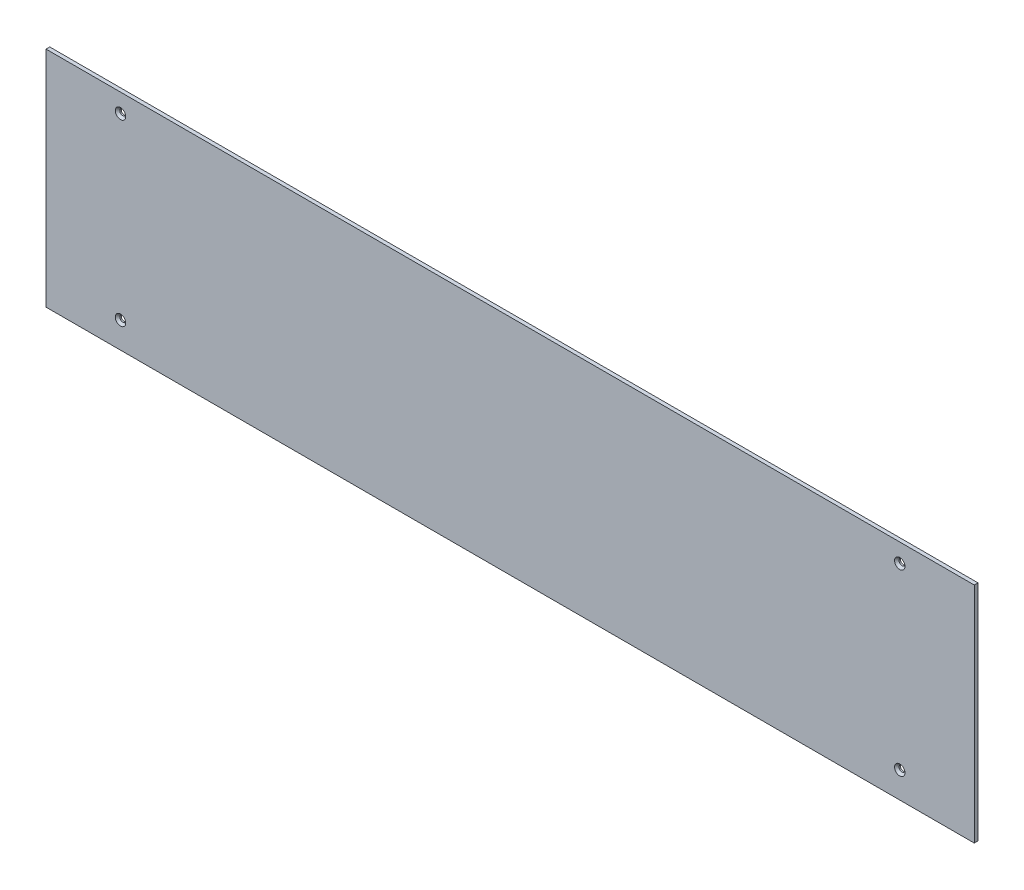
ISO-10303-21;
HEADER;
FILE_DESCRIPTION(('STEP AP214'),'2;1');
FILE_NAME('part.step','',(''),(''),'','','');
FILE_SCHEMA(('AUTOMOTIVE_DESIGN { 1 0 10303 214 1 1 1 1 }'));
ENDSEC;
DATA;
#1=APPLICATION_CONTEXT('core data for automotive mechanical design processes');
#2=APPLICATION_PROTOCOL_DEFINITION('international standard','automotive_design',2000,#1);
#3=PRODUCT_CONTEXT('',#1,'mechanical');
#4=PRODUCT('Part','Part','',(#3));
#5=PRODUCT_RELATED_PRODUCT_CATEGORY('part','',(#4));
#6=PRODUCT_DEFINITION_FORMATION('','',#4);
#7=PRODUCT_DEFINITION_CONTEXT('part definition',#1,'design');
#8=PRODUCT_DEFINITION('design','',#6,#7);
#9=PRODUCT_DEFINITION_SHAPE('','',#8);
#10=(LENGTH_UNIT() NAMED_UNIT(*) SI_UNIT(.MILLI.,.METRE.));
#11=(NAMED_UNIT(*) PLANE_ANGLE_UNIT() SI_UNIT($,.RADIAN.));
#12=(NAMED_UNIT(*) SI_UNIT($,.STERADIAN.) SOLID_ANGLE_UNIT());
#13=UNCERTAINTY_MEASURE_WITH_UNIT(LENGTH_MEASURE(1.E-05),#10,'distance_accuracy_value','');
#14=(GEOMETRIC_REPRESENTATION_CONTEXT(3) GLOBAL_UNCERTAINTY_ASSIGNED_CONTEXT((#13)) GLOBAL_UNIT_ASSIGNED_CONTEXT((#10,
#11,#12)) REPRESENTATION_CONTEXT('',''));
#15=CARTESIAN_POINT('',(0.,0.,0.));
#16=DIRECTION('',(0.,0.,1.));
#17=DIRECTION('',(1.,0.,0.));
#18=AXIS2_PLACEMENT_3D('',#15,#16,#17);
#19=CARTESIAN_POINT('',(623.,-150.,5.));
#20=DIRECTION('',(-1.,0.,0.));
#21=DIRECTION('',(0.,0.,1.));
#22=AXIS2_PLACEMENT_3D('',#19,#20,#21);
#23=PLANE('',#22);
#24=DIRECTION('',(0.,1.,0.));
#25=VECTOR('',#24,1.);
#26=CARTESIAN_POINT('',(623.,-150.,0.));
#27=LINE('',#26,#25);
#28=CARTESIAN_POINT('',(623.,-150.,0.));
#29=VERTEX_POINT('',#28);
#30=CARTESIAN_POINT('',(623.,150.,0.));
#31=VERTEX_POINT('',#30);
#32=EDGE_CURVE('E103',#29,#31,#27,.T.);
#33=ORIENTED_EDGE('',*,*,#32,.T.);
#34=DIRECTION('',(0.,0.,-1.));
#35=VECTOR('',#34,1.);
#36=CARTESIAN_POINT('',(623.,150.,5.));
#37=LINE('',#36,#35);
#38=CARTESIAN_POINT('',(623.,150.,5.));
#39=VERTEX_POINT('',#38);
#40=EDGE_CURVE('E94',#39,#31,#37,.T.);
#41=ORIENTED_EDGE('',*,*,#40,.F.);
#42=DIRECTION('',(0.,1.,0.));
#43=VECTOR('',#42,1.);
#44=CARTESIAN_POINT('',(623.,-150.,5.));
#45=LINE('',#44,#43);
#46=CARTESIAN_POINT('',(623.,-150.,5.));
#47=VERTEX_POINT('',#46);
#48=EDGE_CURVE('E88',#47,#39,#45,.T.);
#49=ORIENTED_EDGE('',*,*,#48,.F.);
#50=DIRECTION('',(0.,0.,-1.));
#51=VECTOR('',#50,1.);
#52=CARTESIAN_POINT('',(623.,-150.,5.));
#53=LINE('',#52,#51);
#54=EDGE_CURVE('E99',#47,#29,#53,.T.);
#55=ORIENTED_EDGE('',*,*,#54,.T.);
#56=EDGE_LOOP('',(#33,#41,#49,#55));
#57=FACE_BOUND('',#56,.T.);
#58=ADVANCED_FACE('F35',(#57),#23,.F.);
#59=CARTESIAN_POINT('',(-623.,150.,5.));
#60=DIRECTION('',(0.,-1.,0.));
#61=DIRECTION('',(0.,0.,-1.));
#62=AXIS2_PLACEMENT_3D('',#59,#60,#61);
#63=PLANE('',#62);
#64=DIRECTION('',(-1.,0.,0.));
#65=VECTOR('',#64,1.);
#66=CARTESIAN_POINT('',(-623.,150.,0.));
#67=LINE('',#66,#65);
#68=CARTESIAN_POINT('',(-623.,150.,0.));
#69=VERTEX_POINT('',#68);
#70=EDGE_CURVE('E93',#31,#69,#67,.T.);
#71=ORIENTED_EDGE('',*,*,#70,.T.);
#72=DIRECTION('',(0.,0.,-1.));
#73=VECTOR('',#72,1.);
#74=CARTESIAN_POINT('',(-623.,150.,5.));
#75=LINE('',#74,#73);
#76=CARTESIAN_POINT('',(-623.,150.,5.));
#77=VERTEX_POINT('',#76);
#78=EDGE_CURVE('E91',#77,#69,#75,.T.);
#79=ORIENTED_EDGE('',*,*,#78,.F.);
#80=DIRECTION('',(-1.,0.,0.));
#81=VECTOR('',#80,1.);
#82=CARTESIAN_POINT('',(-623.,150.,5.));
#83=LINE('',#82,#81);
#84=EDGE_CURVE('E83',#39,#77,#83,.T.);
#85=ORIENTED_EDGE('',*,*,#84,.F.);
#86=ORIENTED_EDGE('',*,*,#40,.T.);
#87=EDGE_LOOP('',(#71,#79,#85,#86));
#88=FACE_BOUND('',#87,.T.);
#89=ADVANCED_FACE('F92',(#88),#63,.F.);
#90=CARTESIAN_POINT('',(-623.,-150.,5.));
#91=DIRECTION('',(1.,0.,0.));
#92=DIRECTION('',(0.,0.,-1.));
#93=AXIS2_PLACEMENT_3D('',#90,#91,#92);
#94=PLANE('',#93);
#95=DIRECTION('',(0.,-1.,0.));
#96=VECTOR('',#95,1.);
#97=CARTESIAN_POINT('',(-623.,-150.,0.));
#98=LINE('',#97,#96);
#99=CARTESIAN_POINT('',(-623.,-150.,0.));
#100=VERTEX_POINT('',#99);
#101=EDGE_CURVE('E69',#69,#100,#98,.T.);
#102=ORIENTED_EDGE('',*,*,#101,.T.);
#103=DIRECTION('',(0.,0.,-1.));
#104=VECTOR('',#103,1.);
#105=CARTESIAN_POINT('',(-623.,-150.,5.));
#106=LINE('',#105,#104);
#107=CARTESIAN_POINT('',(-623.,-150.,5.));
#108=VERTEX_POINT('',#107);
#109=EDGE_CURVE('E95',#108,#100,#106,.T.);
#110=ORIENTED_EDGE('',*,*,#109,.F.);
#111=DIRECTION('',(0.,-1.,0.));
#112=VECTOR('',#111,1.);
#113=CARTESIAN_POINT('',(-623.,-150.,5.));
#114=LINE('',#113,#112);
#115=EDGE_CURVE('E86',#77,#108,#114,.T.);
#116=ORIENTED_EDGE('',*,*,#115,.F.);
#117=ORIENTED_EDGE('',*,*,#78,.T.);
#118=EDGE_LOOP('',(#102,#110,#116,#117));
#119=FACE_BOUND('',#118,.T.);
#120=ADVANCED_FACE('F97',(#119),#94,.F.);
#121=CARTESIAN_POINT('',(-623.,-150.,5.));
#122=DIRECTION('',(0.,1.,0.));
#123=DIRECTION('',(0.,0.,1.));
#124=AXIS2_PLACEMENT_3D('',#121,#122,#123);
#125=PLANE('',#124);
#126=DIRECTION('',(1.,0.,0.));
#127=VECTOR('',#126,1.);
#128=CARTESIAN_POINT('',(-623.,-150.,0.));
#129=LINE('',#128,#127);
#130=EDGE_CURVE('E75',#100,#29,#129,.T.);
#131=ORIENTED_EDGE('',*,*,#130,.T.);
#132=ORIENTED_EDGE('',*,*,#54,.F.);
#133=DIRECTION('',(1.,0.,0.));
#134=VECTOR('',#133,1.);
#135=CARTESIAN_POINT('',(-623.,-150.,5.));
#136=LINE('',#135,#134);
#137=EDGE_CURVE('E52',#108,#47,#136,.T.);
#138=ORIENTED_EDGE('',*,*,#137,.F.);
#139=ORIENTED_EDGE('',*,*,#109,.T.);
#140=EDGE_LOOP('',(#131,#132,#138,#139));
#141=FACE_BOUND('',#140,.T.);
#142=ADVANCED_FACE('F202',(#141),#125,.F.);
#143=CARTESIAN_POINT('',(0.,0.,5.));
#144=DIRECTION('',(0.,0.,-1.));
#145=DIRECTION('',(-1.,0.,0.));
#146=AXIS2_PLACEMENT_3D('',#143,#144,#145);
#147=PLANE('',#146);
#148=CARTESIAN_POINT('',(-523.,-115.,5.));
#149=DIRECTION('',(0.,0.,-1.));
#150=DIRECTION('',(-1.,0.,0.));
#151=AXIS2_PLACEMENT_3D('',#148,#149,#150);
#152=CIRCLE('',#151,6.99999999999978);
#153=CARTESIAN_POINT('',(-530.,-115.,5.));
#154=VERTEX_POINT('',#153);
#155=EDGE_CURVE('E125',#154,#154,#152,.T.);
#156=ORIENTED_EDGE('',*,*,#155,.T.);
#157=EDGE_LOOP('',(#156));
#158=FACE_BOUND('',#157,.T.);
#159=CARTESIAN_POINT('',(523.,-115.,5.));
#160=DIRECTION('',(0.,0.,-1.));
#161=DIRECTION('',(-1.,0.,0.));
#162=AXIS2_PLACEMENT_3D('',#159,#160,#161);
#163=CIRCLE('',#162,6.99999999999978);
#164=CARTESIAN_POINT('',(516.,-115.,5.));
#165=VERTEX_POINT('',#164);
#166=EDGE_CURVE('E122',#165,#165,#163,.T.);
#167=ORIENTED_EDGE('',*,*,#166,.T.);
#168=EDGE_LOOP('',(#167));
#169=FACE_BOUND('',#168,.T.);
#170=CARTESIAN_POINT('',(523.,125.,5.));
#171=DIRECTION('',(0.,0.,-1.));
#172=DIRECTION('',(-1.,0.,0.));
#173=AXIS2_PLACEMENT_3D('',#170,#171,#172);
#174=CIRCLE('',#173,6.99999999999978);
#175=CARTESIAN_POINT('',(516.,125.,5.));
#176=VERTEX_POINT('',#175);
#177=EDGE_CURVE('E119',#176,#176,#174,.T.);
#178=ORIENTED_EDGE('',*,*,#177,.T.);
#179=EDGE_LOOP('',(#178));
#180=FACE_BOUND('',#179,.T.);
#181=CARTESIAN_POINT('',(-523.,125.,5.));
#182=DIRECTION('',(0.,0.,-1.));
#183=DIRECTION('',(-1.,0.,0.));
#184=AXIS2_PLACEMENT_3D('',#181,#182,#183);
#185=CIRCLE('',#184,6.99999999999978);
#186=CARTESIAN_POINT('',(-530.,125.,5.));
#187=VERTEX_POINT('',#186);
#188=EDGE_CURVE('E116',#187,#187,#185,.T.);
#189=ORIENTED_EDGE('',*,*,#188,.T.);
#190=EDGE_LOOP('',(#189));
#191=FACE_BOUND('',#190,.T.);
#192=ORIENTED_EDGE('',*,*,#48,.T.);
#193=ORIENTED_EDGE('',*,*,#84,.T.);
#194=ORIENTED_EDGE('',*,*,#115,.T.);
#195=ORIENTED_EDGE('',*,*,#137,.T.);
#196=EDGE_LOOP('',(#192,#193,#194,#195));
#197=FACE_BOUND('',#196,.T.);
#198=ADVANCED_FACE('F84',(#158,#169,#180,#191,#197),#147,.F.);
#199=CARTESIAN_POINT('',(0.,0.,0.));
#200=DIRECTION('',(0.,0.,-1.));
#201=DIRECTION('',(-1.,0.,0.));
#202=AXIS2_PLACEMENT_3D('',#199,#200,#201);
#203=PLANE('',#202);
#204=CARTESIAN_POINT('',(-523.,-115.,0.));
#205=DIRECTION('',(0.,0.,1.));
#206=DIRECTION('',(1.,0.,0.));
#207=AXIS2_PLACEMENT_3D('',#204,#205,#206);
#208=CIRCLE('',#207,3.99999999999999);
#209=CARTESIAN_POINT('',(-519.,-115.,0.));
#210=VERTEX_POINT('',#209);
#211=EDGE_CURVE('E173',#210,#210,#208,.T.);
#212=ORIENTED_EDGE('',*,*,#211,.T.);
#213=EDGE_LOOP('',(#212));
#214=FACE_BOUND('',#213,.T.);
#215=CARTESIAN_POINT('',(523.,-115.,0.));
#216=DIRECTION('',(0.,0.,1.));
#217=DIRECTION('',(1.,0.,0.));
#218=AXIS2_PLACEMENT_3D('',#215,#216,#217);
#219=CIRCLE('',#218,3.99999999999999);
#220=CARTESIAN_POINT('',(527.,-115.,0.));
#221=VERTEX_POINT('',#220);
#222=EDGE_CURVE('E175',#221,#221,#219,.T.);
#223=ORIENTED_EDGE('',*,*,#222,.T.);
#224=EDGE_LOOP('',(#223));
#225=FACE_BOUND('',#224,.T.);
#226=CARTESIAN_POINT('',(523.,125.,0.));
#227=DIRECTION('',(0.,0.,1.));
#228=DIRECTION('',(1.,0.,0.));
#229=AXIS2_PLACEMENT_3D('',#226,#227,#228);
#230=CIRCLE('',#229,3.99999999999999);
#231=CARTESIAN_POINT('',(527.,125.,0.));
#232=VERTEX_POINT('',#231);
#233=EDGE_CURVE('E178',#232,#232,#230,.T.);
#234=ORIENTED_EDGE('',*,*,#233,.T.);
#235=EDGE_LOOP('',(#234));
#236=FACE_BOUND('',#235,.T.);
#237=CARTESIAN_POINT('',(-523.,125.,0.));
#238=DIRECTION('',(0.,0.,1.));
#239=DIRECTION('',(1.,0.,0.));
#240=AXIS2_PLACEMENT_3D('',#237,#238,#239);
#241=CIRCLE('',#240,3.99999999999999);
#242=CARTESIAN_POINT('',(-519.,125.,0.));
#243=VERTEX_POINT('',#242);
#244=EDGE_CURVE('E106',#243,#243,#241,.T.);
#245=ORIENTED_EDGE('',*,*,#244,.T.);
#246=EDGE_LOOP('',(#245));
#247=FACE_BOUND('',#246,.T.);
#248=ORIENTED_EDGE('',*,*,#32,.F.);
#249=ORIENTED_EDGE('',*,*,#130,.F.);
#250=ORIENTED_EDGE('',*,*,#101,.F.);
#251=ORIENTED_EDGE('',*,*,#70,.F.);
#252=EDGE_LOOP('',(#248,#249,#250,#251));
#253=FACE_BOUND('',#252,.T.);
#254=ADVANCED_FACE('F186',(#214,#225,#236,#247,#253),#203,.T.);
#255=CARTESIAN_POINT('',(-523.,125.,0.));
#256=DIRECTION('',(0.,0.,1.));
#257=DIRECTION('',(1.,0.,0.));
#258=AXIS2_PLACEMENT_3D('',#255,#256,#257);
#259=CYLINDRICAL_SURFACE('',#258,3.99999999999999);
#260=CARTESIAN_POINT('',(-523.,125.,2.0000000000002));
#261=DIRECTION('',(0.,0.,-1.));
#262=DIRECTION('',(-1.,0.,0.));
#263=AXIS2_PLACEMENT_3D('',#260,#261,#262);
#264=CIRCLE('',#263,3.99999999999999);
#265=CARTESIAN_POINT('',(-527.,125.,2.0000000000002));
#266=VERTEX_POINT('',#265);
#267=EDGE_CURVE('E11',#266,#266,#264,.F.);
#268=ORIENTED_EDGE('',*,*,#267,.T.);
#269=EDGE_LOOP('',(#268));
#270=FACE_BOUND('',#269,.T.);
#271=ORIENTED_EDGE('',*,*,#244,.F.);
#272=EDGE_LOOP('',(#271));
#273=FACE_BOUND('',#272,.T.);
#274=ADVANCED_FACE('F189',(#270,#273),#259,.F.);
#275=CARTESIAN_POINT('',(523.,125.,0.));
#276=DIRECTION('',(0.,0.,1.));
#277=DIRECTION('',(1.,0.,0.));
#278=AXIS2_PLACEMENT_3D('',#275,#276,#277);
#279=CYLINDRICAL_SURFACE('',#278,3.99999999999999);
#280=CARTESIAN_POINT('',(523.,125.,2.0000000000002));
#281=DIRECTION('',(0.,0.,-1.));
#282=DIRECTION('',(-1.,0.,0.));
#283=AXIS2_PLACEMENT_3D('',#280,#281,#282);
#284=CIRCLE('',#283,3.99999999999999);
#285=CARTESIAN_POINT('',(519.,125.,2.0000000000002));
#286=VERTEX_POINT('',#285);
#287=EDGE_CURVE('E44',#286,#286,#284,.F.);
#288=ORIENTED_EDGE('',*,*,#287,.T.);
#289=EDGE_LOOP('',(#288));
#290=FACE_BOUND('',#289,.T.);
#291=ORIENTED_EDGE('',*,*,#233,.F.);
#292=EDGE_LOOP('',(#291));
#293=FACE_BOUND('',#292,.T.);
#294=ADVANCED_FACE('F133',(#290,#293),#279,.F.);
#295=CARTESIAN_POINT('',(523.,-115.,0.));
#296=DIRECTION('',(0.,0.,1.));
#297=DIRECTION('',(1.,0.,0.));
#298=AXIS2_PLACEMENT_3D('',#295,#296,#297);
#299=CYLINDRICAL_SURFACE('',#298,3.99999999999999);
#300=CARTESIAN_POINT('',(523.,-115.,2.0000000000002));
#301=DIRECTION('',(0.,0.,-1.));
#302=DIRECTION('',(-1.,0.,0.));
#303=AXIS2_PLACEMENT_3D('',#300,#301,#302);
#304=CIRCLE('',#303,3.99999999999999);
#305=CARTESIAN_POINT('',(519.,-115.,2.0000000000002));
#306=VERTEX_POINT('',#305);
#307=EDGE_CURVE('E128',#306,#306,#304,.F.);
#308=ORIENTED_EDGE('',*,*,#307,.T.);
#309=EDGE_LOOP('',(#308));
#310=FACE_BOUND('',#309,.T.);
#311=ORIENTED_EDGE('',*,*,#222,.F.);
#312=EDGE_LOOP('',(#311));
#313=FACE_BOUND('',#312,.T.);
#314=ADVANCED_FACE('F164',(#310,#313),#299,.F.);
#315=CARTESIAN_POINT('',(-523.,-115.,0.));
#316=DIRECTION('',(0.,0.,1.));
#317=DIRECTION('',(1.,0.,0.));
#318=AXIS2_PLACEMENT_3D('',#315,#316,#317);
#319=CYLINDRICAL_SURFACE('',#318,3.99999999999999);
#320=CARTESIAN_POINT('',(-523.,-115.,2.0000000000002));
#321=DIRECTION('',(0.,0.,-1.));
#322=DIRECTION('',(-1.,0.,0.));
#323=AXIS2_PLACEMENT_3D('',#320,#321,#322);
#324=CIRCLE('',#323,3.99999999999999);
#325=CARTESIAN_POINT('',(-527.,-115.,2.0000000000002));
#326=VERTEX_POINT('',#325);
#327=EDGE_CURVE('E113',#326,#326,#324,.F.);
#328=ORIENTED_EDGE('',*,*,#327,.T.);
#329=EDGE_LOOP('',(#328));
#330=FACE_BOUND('',#329,.T.);
#331=ORIENTED_EDGE('',*,*,#211,.F.);
#332=EDGE_LOOP('',(#331));
#333=FACE_BOUND('',#332,.T.);
#334=ADVANCED_FACE('F159',(#330,#333),#319,.F.);
#335=CARTESIAN_POINT('',(-523.,-115.,2.0000000000002));
#336=DIRECTION('',(0.,0.,1.));
#337=DIRECTION('',(1.,0.,0.));
#338=AXIS2_PLACEMENT_3D('',#335,#336,#337);
#339=CONICAL_SURFACE('',#338,3.99999999999999,0.785398163397446);
#340=ORIENTED_EDGE('',*,*,#155,.F.);
#341=EDGE_LOOP('',(#340));
#342=FACE_BOUND('',#341,.T.);
#343=ORIENTED_EDGE('',*,*,#327,.F.);
#344=EDGE_LOOP('',(#343));
#345=FACE_BOUND('',#344,.T.);
#346=ADVANCED_FACE('F145',(#342,#345),#339,.F.);
#347=CARTESIAN_POINT('',(523.,-115.,2.0000000000002));
#348=DIRECTION('',(0.,0.,1.));
#349=DIRECTION('',(1.,0.,0.));
#350=AXIS2_PLACEMENT_3D('',#347,#348,#349);
#351=CONICAL_SURFACE('',#350,3.99999999999999,0.785398163397446);
#352=ORIENTED_EDGE('',*,*,#166,.F.);
#353=EDGE_LOOP('',(#352));
#354=FACE_BOUND('',#353,.T.);
#355=ORIENTED_EDGE('',*,*,#307,.F.);
#356=EDGE_LOOP('',(#355));
#357=FACE_BOUND('',#356,.T.);
#358=ADVANCED_FACE('F138',(#354,#357),#351,.F.);
#359=CARTESIAN_POINT('',(523.,125.,2.0000000000002));
#360=DIRECTION('',(0.,0.,1.));
#361=DIRECTION('',(1.,0.,0.));
#362=AXIS2_PLACEMENT_3D('',#359,#360,#361);
#363=CONICAL_SURFACE('',#362,3.99999999999999,0.785398163397446);
#364=ORIENTED_EDGE('',*,*,#177,.F.);
#365=EDGE_LOOP('',(#364));
#366=FACE_BOUND('',#365,.T.);
#367=ORIENTED_EDGE('',*,*,#287,.F.);
#368=EDGE_LOOP('',(#367));
#369=FACE_BOUND('',#368,.T.);
#370=ADVANCED_FACE('F136',(#366,#369),#363,.F.);
#371=CARTESIAN_POINT('',(-523.,125.,2.0000000000002));
#372=DIRECTION('',(0.,0.,1.));
#373=DIRECTION('',(1.,0.,0.));
#374=AXIS2_PLACEMENT_3D('',#371,#372,#373);
#375=CONICAL_SURFACE('',#374,3.99999999999999,0.785398163397446);
#376=ORIENTED_EDGE('',*,*,#188,.F.);
#377=EDGE_LOOP('',(#376));
#378=FACE_BOUND('',#377,.T.);
#379=ORIENTED_EDGE('',*,*,#267,.F.);
#380=EDGE_LOOP('',(#379));
#381=FACE_BOUND('',#380,.T.);
#382=ADVANCED_FACE('F37',(#378,#381),#375,.F.);
#383=CLOSED_SHELL('',(#58,#89,#120,#142,#198,#254,#274,#294,#314,#334,#346,#358,#370,#382));
#384=MANIFOLD_SOLID_BREP('B2',#383);
#385=ADVANCED_BREP_SHAPE_REPRESENTATION('',(#18,#384),#14);
#386=SHAPE_DEFINITION_REPRESENTATION(#9,#385);
ENDSEC;
END-ISO-10303-21;
